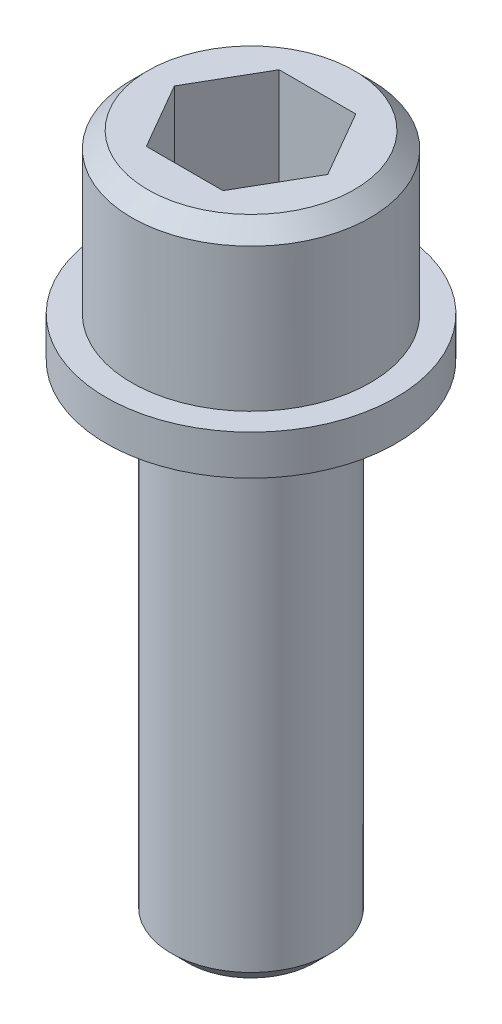
ISO-10303-21;
HEADER;
FILE_DESCRIPTION(('STEP AP214'),'2;1');
FILE_NAME('part.step','',(''),(''),'','','');
FILE_SCHEMA(('AUTOMOTIVE_DESIGN { 1 0 10303 214 1 1 1 1 }'));
ENDSEC;
DATA;
#1=APPLICATION_CONTEXT('core data for automotive mechanical design processes');
#2=APPLICATION_PROTOCOL_DEFINITION('international standard','automotive_design',2000,#1);
#3=PRODUCT_CONTEXT('',#1,'mechanical');
#4=PRODUCT('Part','Part','',(#3));
#5=PRODUCT_RELATED_PRODUCT_CATEGORY('part','',(#4));
#6=PRODUCT_DEFINITION_FORMATION('','',#4);
#7=PRODUCT_DEFINITION_CONTEXT('part definition',#1,'design');
#8=PRODUCT_DEFINITION('design','',#6,#7);
#9=PRODUCT_DEFINITION_SHAPE('','',#8);
#10=(LENGTH_UNIT() NAMED_UNIT(*) SI_UNIT(.MILLI.,.METRE.));
#11=(NAMED_UNIT(*) PLANE_ANGLE_UNIT() SI_UNIT($,.RADIAN.));
#12=(NAMED_UNIT(*) SI_UNIT($,.STERADIAN.) SOLID_ANGLE_UNIT());
#13=UNCERTAINTY_MEASURE_WITH_UNIT(LENGTH_MEASURE(1.E-05),#10,'distance_accuracy_value','');
#14=(GEOMETRIC_REPRESENTATION_CONTEXT(3) GLOBAL_UNCERTAINTY_ASSIGNED_CONTEXT((#13)) GLOBAL_UNIT_ASSIGNED_CONTEXT((#10,
#11,#12)) REPRESENTATION_CONTEXT('',''));
#15=CARTESIAN_POINT('',(0.,0.,0.));
#16=DIRECTION('',(0.,0.,1.));
#17=DIRECTION('',(1.,0.,0.));
#18=AXIS2_PLACEMENT_3D('',#15,#16,#17);
#19=CARTESIAN_POINT('',(0.,41.275,0.));
#20=DIRECTION('',(0.,1.,0.));
#21=DIRECTION('',(0.,0.,1.));
#22=AXIS2_PLACEMENT_3D('',#19,#20,#21);
#23=PLANE('',#22);
#24=CARTESIAN_POINT('',(0.,41.275,0.));
#25=DIRECTION('',(0.,1.,0.));
#26=DIRECTION('',(0.,0.,1.));
#27=AXIS2_PLACEMENT_3D('',#24,#25,#26);
#28=CIRCLE('',#27,6.17855);
#29=CARTESIAN_POINT('',(0.,41.275,6.17855));
#30=VERTEX_POINT('',#29);
#31=EDGE_CURVE('E155',#30,#30,#28,.T.);
#32=ORIENTED_EDGE('',*,*,#31,.T.);
#33=EDGE_LOOP('',(#32));
#34=FACE_BOUND('',#33,.T.);
#35=DIRECTION('',(0.499999999999999,0.,-0.866025403784439));
#36=VECTOR('',#35,1.);
#37=CARTESIAN_POINT('',(2.29502505505568,41.275,3.9751));
#38=LINE('',#37,#36);
#39=CARTESIAN_POINT('',(2.29502505505568,41.275,3.9751));
#40=VERTEX_POINT('',#39);
#41=CARTESIAN_POINT('',(4.59005011011136,41.275,0.));
#42=VERTEX_POINT('',#41);
#43=EDGE_CURVE('E48',#40,#42,#38,.T.);
#44=ORIENTED_EDGE('',*,*,#43,.F.);
#45=DIRECTION('',(1.,0.,0.));
#46=VECTOR('',#45,1.);
#47=CARTESIAN_POINT('',(-2.29502505505568,41.275,3.9751));
#48=LINE('',#47,#46);
#49=CARTESIAN_POINT('',(-2.29502505505568,41.275,3.9751));
#50=VERTEX_POINT('',#49);
#51=EDGE_CURVE('E131',#50,#40,#48,.T.);
#52=ORIENTED_EDGE('',*,*,#51,.F.);
#53=DIRECTION('',(0.5,0.,0.866025403784438));
#54=VECTOR('',#53,1.);
#55=CARTESIAN_POINT('',(-4.59005011011136,41.275,0.));
#56=LINE('',#55,#54);
#57=CARTESIAN_POINT('',(-4.59005011011136,41.275,0.));
#58=VERTEX_POINT('',#57);
#59=EDGE_CURVE('E129',#58,#50,#56,.T.);
#60=ORIENTED_EDGE('',*,*,#59,.F.);
#61=DIRECTION('',(-0.5,0.,0.866025403784439));
#62=VECTOR('',#61,1.);
#63=CARTESIAN_POINT('',(-2.29502505505568,41.275,-3.9751));
#64=LINE('',#63,#62);
#65=CARTESIAN_POINT('',(-2.29502505505568,41.275,-3.9751));
#66=VERTEX_POINT('',#65);
#67=EDGE_CURVE('E96',#66,#58,#64,.T.);
#68=ORIENTED_EDGE('',*,*,#67,.F.);
#69=DIRECTION('',(-1.,0.,0.));
#70=VECTOR('',#69,1.);
#71=CARTESIAN_POINT('',(2.29502505505568,41.275,-3.9751));
#72=LINE('',#71,#70);
#73=CARTESIAN_POINT('',(2.29502505505568,41.275,-3.9751));
#74=VERTEX_POINT('',#73);
#75=EDGE_CURVE('E125',#74,#66,#72,.T.);
#76=ORIENTED_EDGE('',*,*,#75,.F.);
#77=DIRECTION('',(-0.5,0.,-0.866025403784439));
#78=VECTOR('',#77,1.);
#79=CARTESIAN_POINT('',(4.59005011011136,41.275,0.));
#80=LINE('',#79,#78);
#81=EDGE_CURVE('E122',#42,#74,#80,.T.);
#82=ORIENTED_EDGE('',*,*,#81,.F.);
#83=EDGE_LOOP('',(#44,#52,#60,#68,#76,#82));
#84=FACE_BOUND('',#83,.T.);
#85=ADVANCED_FACE('F33',(#34,#84),#23,.T.);
#86=CARTESIAN_POINT('',(0.,0.,0.));
#87=DIRECTION('',(0.,-1.,0.));
#88=DIRECTION('',(0.,0.,-1.));
#89=AXIS2_PLACEMENT_3D('',#86,#87,#88);
#90=CYLINDRICAL_SURFACE('',#89,7.14375);
#91=CARTESIAN_POINT('',(0.,40.3098,0.));
#92=DIRECTION('',(0.,1.,0.));
#93=DIRECTION('',(0.,0.,1.));
#94=AXIS2_PLACEMENT_3D('',#91,#92,#93);
#95=CIRCLE('',#94,7.14375);
#96=CARTESIAN_POINT('',(0.,40.3098,7.14375));
#97=VERTEX_POINT('',#96);
#98=EDGE_CURVE('E152',#97,#97,#95,.F.);
#99=ORIENTED_EDGE('',*,*,#98,.T.);
#100=EDGE_LOOP('',(#99));
#101=FACE_BOUND('',#100,.T.);
#102=CARTESIAN_POINT('',(0.,31.75,0.));
#103=DIRECTION('',(0.,-1.,0.));
#104=DIRECTION('',(0.,0.,-1.));
#105=AXIS2_PLACEMENT_3D('',#102,#103,#104);
#106=CIRCLE('',#105,7.14375);
#107=CARTESIAN_POINT('',(0.,31.75,-7.14375));
#108=VERTEX_POINT('',#107);
#109=EDGE_CURVE('E149',#108,#108,#106,.T.);
#110=ORIENTED_EDGE('',*,*,#109,.F.);
#111=EDGE_LOOP('',(#110));
#112=FACE_BOUND('',#111,.T.);
#113=ADVANCED_FACE('F171',(#101,#112),#90,.T.);
#114=CARTESIAN_POINT('',(7.14375,31.75,0.));
#115=DIRECTION('',(0.,1.,0.));
#116=DIRECTION('',(0.,0.,1.));
#117=AXIS2_PLACEMENT_3D('',#114,#115,#116);
#118=PLANE('',#117);
#119=ORIENTED_EDGE('',*,*,#109,.T.);
#120=EDGE_LOOP('',(#119));
#121=FACE_BOUND('',#120,.T.);
#122=CARTESIAN_POINT('',(0.,31.75,0.));
#123=DIRECTION('',(0.,-1.,0.));
#124=DIRECTION('',(0.,0.,-1.));
#125=AXIS2_PLACEMENT_3D('',#122,#123,#124);
#126=CIRCLE('',#125,8.6741);
#127=CARTESIAN_POINT('',(0.,31.75,-8.6741));
#128=VERTEX_POINT('',#127);
#129=EDGE_CURVE('E146',#128,#128,#126,.T.);
#130=ORIENTED_EDGE('',*,*,#129,.F.);
#131=EDGE_LOOP('',(#130));
#132=FACE_BOUND('',#131,.T.);
#133=ADVANCED_FACE('F177',(#121,#132),#118,.T.);
#134=CARTESIAN_POINT('',(0.,0.,0.));
#135=DIRECTION('',(0.,-1.,0.));
#136=DIRECTION('',(0.,0.,-1.));
#137=AXIS2_PLACEMENT_3D('',#134,#135,#136);
#138=CYLINDRICAL_SURFACE('',#137,8.6741);
#139=ORIENTED_EDGE('',*,*,#129,.T.);
#140=EDGE_LOOP('',(#139));
#141=FACE_BOUND('',#140,.T.);
#142=CARTESIAN_POINT('',(0.,29.3624,0.));
#143=DIRECTION('',(0.,-1.,0.));
#144=DIRECTION('',(0.,0.,-1.));
#145=AXIS2_PLACEMENT_3D('',#142,#143,#144);
#146=CIRCLE('',#145,8.6741);
#147=CARTESIAN_POINT('',(0.,29.3624,-8.6741));
#148=VERTEX_POINT('',#147);
#149=EDGE_CURVE('E143',#148,#148,#146,.T.);
#150=ORIENTED_EDGE('',*,*,#149,.F.);
#151=EDGE_LOOP('',(#150));
#152=FACE_BOUND('',#151,.T.);
#153=ADVANCED_FACE('F184',(#141,#152),#138,.T.);
#154=CARTESIAN_POINT('',(8.6741,29.3624,0.));
#155=DIRECTION('',(0.,-1.,0.));
#156=DIRECTION('',(0.,0.,-1.));
#157=AXIS2_PLACEMENT_3D('',#154,#155,#156);
#158=PLANE('',#157);
#159=ORIENTED_EDGE('',*,*,#149,.T.);
#160=EDGE_LOOP('',(#159));
#161=FACE_BOUND('',#160,.T.);
#162=CARTESIAN_POINT('',(0.,29.3624,0.));
#163=DIRECTION('',(0.,-1.,0.));
#164=DIRECTION('',(0.,0.,-1.));
#165=AXIS2_PLACEMENT_3D('',#162,#163,#164);
#166=CIRCLE('',#165,4.7625);
#167=CARTESIAN_POINT('',(0.,29.3624,-4.7625));
#168=VERTEX_POINT('',#167);
#169=EDGE_CURVE('E135',#168,#168,#166,.T.);
#170=ORIENTED_EDGE('',*,*,#169,.F.);
#171=EDGE_LOOP('',(#170));
#172=FACE_BOUND('',#171,.T.);
#173=ADVANCED_FACE('F188',(#161,#172),#158,.T.);
#174=CARTESIAN_POINT('',(0.,0.,0.));
#175=DIRECTION('',(0.,-1.,0.));
#176=DIRECTION('',(0.,0.,-1.));
#177=AXIS2_PLACEMENT_3D('',#174,#175,#176);
#178=CYLINDRICAL_SURFACE('',#177,4.7625);
#179=CARTESIAN_POINT('',(0.,0.965199999999992,0.));
#180=DIRECTION('',(0.,-1.,0.));
#181=DIRECTION('',(0.,0.,-1.));
#182=AXIS2_PLACEMENT_3D('',#179,#180,#181);
#183=CIRCLE('',#182,4.7625);
#184=CARTESIAN_POINT('',(0.,0.965199999999992,-4.7625));
#185=VERTEX_POINT('',#184);
#186=EDGE_CURVE('E11',#185,#185,#183,.F.);
#187=ORIENTED_EDGE('',*,*,#186,.T.);
#188=EDGE_LOOP('',(#187));
#189=FACE_BOUND('',#188,.T.);
#190=ORIENTED_EDGE('',*,*,#169,.T.);
#191=EDGE_LOOP('',(#190));
#192=FACE_BOUND('',#191,.T.);
#193=ADVANCED_FACE('F192',(#189,#192),#178,.T.);
#194=CARTESIAN_POINT('',(4.7625,0.,0.));
#195=DIRECTION('',(0.,-1.,0.));
#196=DIRECTION('',(0.,0.,-1.));
#197=AXIS2_PLACEMENT_3D('',#194,#195,#196);
#198=PLANE('',#197);
#199=CARTESIAN_POINT('',(0.,0.,0.));
#200=DIRECTION('',(0.,-1.,0.));
#201=DIRECTION('',(0.,0.,-1.));
#202=AXIS2_PLACEMENT_3D('',#199,#200,#201);
#203=CIRCLE('',#202,3.7973);
#204=CARTESIAN_POINT('',(0.,0.,-3.7973));
#205=VERTEX_POINT('',#204);
#206=EDGE_CURVE('E41',#205,#205,#203,.T.);
#207=ORIENTED_EDGE('',*,*,#206,.T.);
#208=EDGE_LOOP('',(#207));
#209=FACE_BOUND('',#208,.T.);
#210=ADVANCED_FACE('F160',(#209),#198,.T.);
#211=CARTESIAN_POINT('',(2.29502505505568,34.925,3.9751));
#212=DIRECTION('',(0.866025403784439,0.,0.499999999999999));
#213=DIRECTION('',(0.499999999999999,0.,-0.866025403784439));
#214=AXIS2_PLACEMENT_3D('',#211,#212,#213);
#215=PLANE('',#214);
#216=ORIENTED_EDGE('',*,*,#43,.T.);
#217=DIRECTION('',(0.,1.,0.));
#218=VECTOR('',#217,1.);
#219=CARTESIAN_POINT('',(4.59005011011136,34.925,0.));
#220=LINE('',#219,#218);
#221=CARTESIAN_POINT('',(4.59005011011136,34.925,0.));
#222=VERTEX_POINT('',#221);
#223=EDGE_CURVE('E78',#222,#42,#220,.T.);
#224=ORIENTED_EDGE('',*,*,#223,.F.);
#225=DIRECTION('',(0.499999999999999,0.,-0.866025403784439));
#226=VECTOR('',#225,1.);
#227=CARTESIAN_POINT('',(2.29502505505568,34.925,3.9751));
#228=LINE('',#227,#226);
#229=CARTESIAN_POINT('',(2.29502505505568,34.925,3.9751));
#230=VERTEX_POINT('',#229);
#231=EDGE_CURVE('E133',#230,#222,#228,.T.);
#232=ORIENTED_EDGE('',*,*,#231,.F.);
#233=DIRECTION('',(0.,1.,0.));
#234=VECTOR('',#233,1.);
#235=CARTESIAN_POINT('',(2.29502505505568,34.925,3.9751));
#236=LINE('',#235,#234);
#237=EDGE_CURVE('E56',#230,#40,#236,.T.);
#238=ORIENTED_EDGE('',*,*,#237,.T.);
#239=EDGE_LOOP('',(#216,#224,#232,#238));
#240=FACE_BOUND('',#239,.T.);
#241=ADVANCED_FACE('F199',(#240),#215,.F.);
#242=CARTESIAN_POINT('',(-2.29502505505568,34.925,3.9751));
#243=DIRECTION('',(0.,0.,1.));
#244=DIRECTION('',(1.,0.,0.));
#245=AXIS2_PLACEMENT_3D('',#242,#243,#244);
#246=PLANE('',#245);
#247=ORIENTED_EDGE('',*,*,#51,.T.);
#248=ORIENTED_EDGE('',*,*,#237,.F.);
#249=DIRECTION('',(1.,0.,0.));
#250=VECTOR('',#249,1.);
#251=CARTESIAN_POINT('',(-2.29502505505568,34.925,3.9751));
#252=LINE('',#251,#250);
#253=CARTESIAN_POINT('',(-2.29502505505568,34.925,3.9751));
#254=VERTEX_POINT('',#253);
#255=EDGE_CURVE('E108',#254,#230,#252,.T.);
#256=ORIENTED_EDGE('',*,*,#255,.F.);
#257=DIRECTION('',(0.,1.,0.));
#258=VECTOR('',#257,1.);
#259=CARTESIAN_POINT('',(-2.29502505505568,34.925,3.9751));
#260=LINE('',#259,#258);
#261=EDGE_CURVE('E100',#254,#50,#260,.T.);
#262=ORIENTED_EDGE('',*,*,#261,.T.);
#263=EDGE_LOOP('',(#247,#248,#256,#262));
#264=FACE_BOUND('',#263,.T.);
#265=ADVANCED_FACE('F202',(#264),#246,.F.);
#266=CARTESIAN_POINT('',(-4.59005011011136,34.925,0.));
#267=DIRECTION('',(-0.866025403784438,0.,0.5));
#268=DIRECTION('',(0.5,0.,0.866025403784438));
#269=AXIS2_PLACEMENT_3D('',#266,#267,#268);
#270=PLANE('',#269);
#271=ORIENTED_EDGE('',*,*,#59,.T.);
#272=ORIENTED_EDGE('',*,*,#261,.F.);
#273=DIRECTION('',(0.5,0.,0.866025403784438));
#274=VECTOR('',#273,1.);
#275=CARTESIAN_POINT('',(-4.59005011011136,34.925,0.));
#276=LINE('',#275,#274);
#277=CARTESIAN_POINT('',(-4.59005011011136,34.925,0.));
#278=VERTEX_POINT('',#277);
#279=EDGE_CURVE('E104',#278,#254,#276,.T.);
#280=ORIENTED_EDGE('',*,*,#279,.F.);
#281=DIRECTION('',(0.,1.,0.));
#282=VECTOR('',#281,1.);
#283=CARTESIAN_POINT('',(-4.59005011011136,34.925,0.));
#284=LINE('',#283,#282);
#285=EDGE_CURVE('E89',#278,#58,#284,.T.);
#286=ORIENTED_EDGE('',*,*,#285,.T.);
#287=EDGE_LOOP('',(#271,#272,#280,#286));
#288=FACE_BOUND('',#287,.T.);
#289=ADVANCED_FACE('F105',(#288),#270,.F.);
#290=CARTESIAN_POINT('',(-2.29502505505568,34.925,-3.9751));
#291=DIRECTION('',(-0.866025403784439,0.,-0.5));
#292=DIRECTION('',(-0.5,0.,0.866025403784439));
#293=AXIS2_PLACEMENT_3D('',#290,#291,#292);
#294=PLANE('',#293);
#295=ORIENTED_EDGE('',*,*,#67,.T.);
#296=ORIENTED_EDGE('',*,*,#285,.F.);
#297=DIRECTION('',(-0.5,0.,0.866025403784439));
#298=VECTOR('',#297,1.);
#299=CARTESIAN_POINT('',(-2.29502505505568,34.925,-3.9751));
#300=LINE('',#299,#298);
#301=CARTESIAN_POINT('',(-2.29502505505568,34.925,-3.9751));
#302=VERTEX_POINT('',#301);
#303=EDGE_CURVE('E93',#302,#278,#300,.T.);
#304=ORIENTED_EDGE('',*,*,#303,.F.);
#305=DIRECTION('',(0.,1.,0.));
#306=VECTOR('',#305,1.);
#307=CARTESIAN_POINT('',(-2.29502505505568,34.925,-3.9751));
#308=LINE('',#307,#306);
#309=EDGE_CURVE('E101',#302,#66,#308,.T.);
#310=ORIENTED_EDGE('',*,*,#309,.T.);
#311=EDGE_LOOP('',(#295,#296,#304,#310));
#312=FACE_BOUND('',#311,.T.);
#313=ADVANCED_FACE('F91',(#312),#294,.F.);
#314=CARTESIAN_POINT('',(2.29502505505568,34.925,-3.9751));
#315=DIRECTION('',(0.,0.,-1.));
#316=DIRECTION('',(-1.,0.,0.));
#317=AXIS2_PLACEMENT_3D('',#314,#315,#316);
#318=PLANE('',#317);
#319=ORIENTED_EDGE('',*,*,#75,.T.);
#320=ORIENTED_EDGE('',*,*,#309,.F.);
#321=DIRECTION('',(-1.,0.,0.));
#322=VECTOR('',#321,1.);
#323=CARTESIAN_POINT('',(2.29502505505568,34.925,-3.9751));
#324=LINE('',#323,#322);
#325=CARTESIAN_POINT('',(2.29502505505568,34.925,-3.9751));
#326=VERTEX_POINT('',#325);
#327=EDGE_CURVE('E114',#326,#302,#324,.T.);
#328=ORIENTED_EDGE('',*,*,#327,.F.);
#329=DIRECTION('',(0.,1.,0.));
#330=VECTOR('',#329,1.);
#331=CARTESIAN_POINT('',(2.29502505505568,34.925,-3.9751));
#332=LINE('',#331,#330);
#333=EDGE_CURVE('E138',#326,#74,#332,.T.);
#334=ORIENTED_EDGE('',*,*,#333,.T.);
#335=EDGE_LOOP('',(#319,#320,#328,#334));
#336=FACE_BOUND('',#335,.T.);
#337=ADVANCED_FACE('F206',(#336),#318,.F.);
#338=CARTESIAN_POINT('',(4.59005011011136,34.925,0.));
#339=DIRECTION('',(0.866025403784438,0.,-0.5));
#340=DIRECTION('',(-0.5,0.,-0.866025403784439));
#341=AXIS2_PLACEMENT_3D('',#338,#339,#340);
#342=PLANE('',#341);
#343=ORIENTED_EDGE('',*,*,#81,.T.);
#344=ORIENTED_EDGE('',*,*,#333,.F.);
#345=DIRECTION('',(-0.5,0.,-0.866025403784439));
#346=VECTOR('',#345,1.);
#347=CARTESIAN_POINT('',(4.59005011011136,34.925,0.));
#348=LINE('',#347,#346);
#349=EDGE_CURVE('E116',#222,#326,#348,.T.);
#350=ORIENTED_EDGE('',*,*,#349,.F.);
#351=ORIENTED_EDGE('',*,*,#223,.T.);
#352=EDGE_LOOP('',(#343,#344,#350,#351));
#353=FACE_BOUND('',#352,.T.);
#354=ADVANCED_FACE('F203',(#353),#342,.F.);
#355=CARTESIAN_POINT('',(0.,34.925,0.));
#356=DIRECTION('',(0.,1.,0.));
#357=DIRECTION('',(0.,0.,1.));
#358=AXIS2_PLACEMENT_3D('',#355,#356,#357);
#359=PLANE('',#358);
#360=ORIENTED_EDGE('',*,*,#231,.T.);
#361=ORIENTED_EDGE('',*,*,#349,.T.);
#362=ORIENTED_EDGE('',*,*,#327,.T.);
#363=ORIENTED_EDGE('',*,*,#303,.T.);
#364=ORIENTED_EDGE('',*,*,#279,.T.);
#365=ORIENTED_EDGE('',*,*,#255,.T.);
#366=EDGE_LOOP('',(#360,#361,#362,#363,#364,#365));
#367=FACE_BOUND('',#366,.T.);
#368=ADVANCED_FACE('F111',(#367),#359,.T.);
#369=CARTESIAN_POINT('',(0.,40.3098,0.));
#370=DIRECTION('',(0.,-1.,0.));
#371=DIRECTION('',(0.,0.,-1.));
#372=AXIS2_PLACEMENT_3D('',#369,#370,#371);
#373=CONICAL_SURFACE('',#372,7.14375,0.785398163397446);
#374=ORIENTED_EDGE('',*,*,#31,.F.);
#375=EDGE_LOOP('',(#374));
#376=FACE_BOUND('',#375,.T.);
#377=ORIENTED_EDGE('',*,*,#98,.F.);
#378=EDGE_LOOP('',(#377));
#379=FACE_BOUND('',#378,.T.);
#380=ADVANCED_FACE('F163',(#376,#379),#373,.T.);
#381=CARTESIAN_POINT('',(0.,0.,0.));
#382=DIRECTION('',(0.,1.,0.));
#383=DIRECTION('',(0.,0.,1.));
#384=AXIS2_PLACEMENT_3D('',#381,#382,#383);
#385=CONICAL_SURFACE('',#384,3.7973,0.78539816339745);
#386=ORIENTED_EDGE('',*,*,#186,.F.);
#387=EDGE_LOOP('',(#386));
#388=FACE_BOUND('',#387,.T.);
#389=ORIENTED_EDGE('',*,*,#206,.F.);
#390=EDGE_LOOP('',(#389));
#391=FACE_BOUND('',#390,.T.);
#392=ADVANCED_FACE('F35',(#388,#391),#385,.T.);
#393=CLOSED_SHELL('',(#85,#113,#133,#153,#173,#193,#210,#241,#265,#289,#313,#337,#354,#368,#380,#392));
#394=MANIFOLD_SOLID_BREP('B2',#393);
#395=ADVANCED_BREP_SHAPE_REPRESENTATION('',(#18,#394),#14);
#396=SHAPE_DEFINITION_REPRESENTATION(#9,#395);
ENDSEC;
END-ISO-10303-21;
